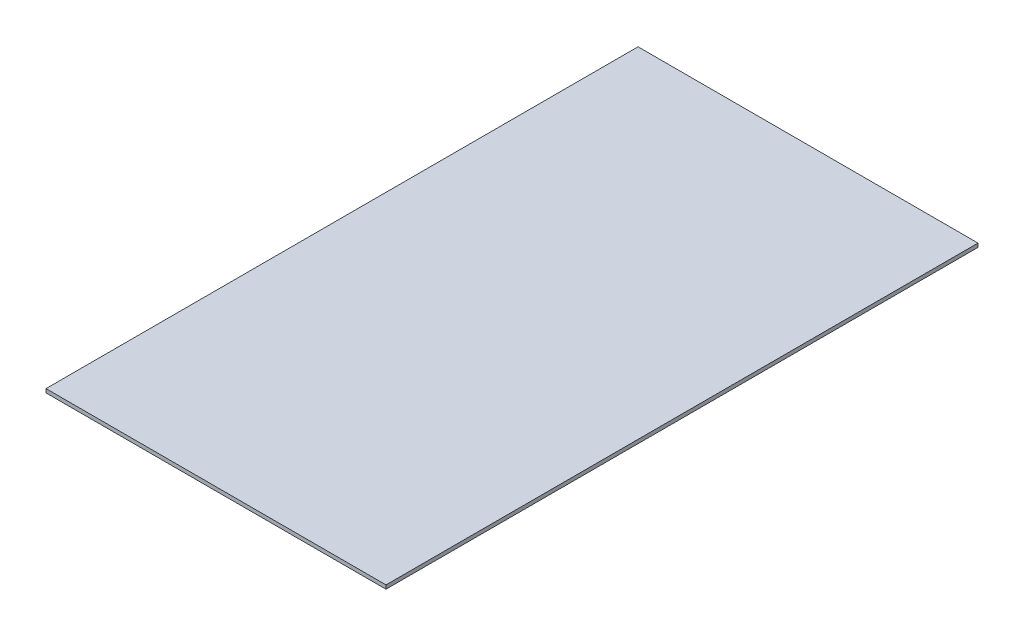
ISO-10303-21;
HEADER;
FILE_DESCRIPTION(('STEP AP214'),'2;1');
FILE_NAME('part.step','',(''),(''),'','','');
FILE_SCHEMA(('AUTOMOTIVE_DESIGN { 1 0 10303 214 1 1 1 1 }'));
ENDSEC;
DATA;
#1=APPLICATION_CONTEXT('core data for automotive mechanical design processes');
#2=APPLICATION_PROTOCOL_DEFINITION('international standard','automotive_design',2000,#1);
#3=PRODUCT_CONTEXT('',#1,'mechanical');
#4=PRODUCT('Part','Part','',(#3));
#5=PRODUCT_RELATED_PRODUCT_CATEGORY('part','',(#4));
#6=PRODUCT_DEFINITION_FORMATION('','',#4);
#7=PRODUCT_DEFINITION_CONTEXT('part definition',#1,'design');
#8=PRODUCT_DEFINITION('design','',#6,#7);
#9=PRODUCT_DEFINITION_SHAPE('','',#8);
#10=(LENGTH_UNIT() NAMED_UNIT(*) SI_UNIT(.MILLI.,.METRE.));
#11=(NAMED_UNIT(*) PLANE_ANGLE_UNIT() SI_UNIT($,.RADIAN.));
#12=(NAMED_UNIT(*) SI_UNIT($,.STERADIAN.) SOLID_ANGLE_UNIT());
#13=UNCERTAINTY_MEASURE_WITH_UNIT(LENGTH_MEASURE(1.E-05),#10,'distance_accuracy_value','');
#14=(GEOMETRIC_REPRESENTATION_CONTEXT(3) GLOBAL_UNCERTAINTY_ASSIGNED_CONTEXT((#13)) GLOBAL_UNIT_ASSIGNED_CONTEXT((#10,
#11,#12)) REPRESENTATION_CONTEXT('',''));
#15=CARTESIAN_POINT('',(0.,0.,0.));
#16=DIRECTION('',(0.,0.,1.));
#17=DIRECTION('',(1.,0.,0.));
#18=AXIS2_PLACEMENT_3D('',#15,#16,#17);
#19=CARTESIAN_POINT('',(145.,3.2,252.5));
#20=DIRECTION('',(-1.,0.,0.));
#21=DIRECTION('',(0.,0.,1.));
#22=AXIS2_PLACEMENT_3D('',#19,#20,#21);
#23=PLANE('',#22);
#24=DIRECTION('',(0.,0.,-1.));
#25=VECTOR('',#24,1.);
#26=CARTESIAN_POINT('',(145.,0.,252.5));
#27=LINE('',#26,#25);
#28=CARTESIAN_POINT('',(145.,0.,252.5));
#29=VERTEX_POINT('',#28);
#30=CARTESIAN_POINT('',(145.,0.,-252.5));
#31=VERTEX_POINT('',#30);
#32=EDGE_CURVE('E98',#29,#31,#27,.T.);
#33=ORIENTED_EDGE('',*,*,#32,.T.);
#34=DIRECTION('',(0.,-1.,0.));
#35=VECTOR('',#34,1.);
#36=CARTESIAN_POINT('',(145.,3.2,-252.5));
#37=LINE('',#36,#35);
#38=CARTESIAN_POINT('',(145.,3.2,-252.5));
#39=VERTEX_POINT('',#38);
#40=EDGE_CURVE('E11',#39,#31,#37,.T.);
#41=ORIENTED_EDGE('',*,*,#40,.F.);
#42=DIRECTION('',(0.,0.,-1.));
#43=VECTOR('',#42,1.);
#44=CARTESIAN_POINT('',(145.,3.2,252.5));
#45=LINE('',#44,#43);
#46=CARTESIAN_POINT('',(145.,3.2,252.5));
#47=VERTEX_POINT('',#46);
#48=EDGE_CURVE('E86',#47,#39,#45,.T.);
#49=ORIENTED_EDGE('',*,*,#48,.F.);
#50=DIRECTION('',(0.,-1.,0.));
#51=VECTOR('',#50,1.);
#52=CARTESIAN_POINT('',(145.,3.2,252.5));
#53=LINE('',#52,#51);
#54=EDGE_CURVE('E94',#47,#29,#53,.T.);
#55=ORIENTED_EDGE('',*,*,#54,.T.);
#56=EDGE_LOOP('',(#33,#41,#49,#55));
#57=FACE_BOUND('',#56,.T.);
#58=ADVANCED_FACE('F35',(#57),#23,.F.);
#59=CARTESIAN_POINT('',(-145.,3.2,-252.5));
#60=DIRECTION('',(0.,0.,1.));
#61=DIRECTION('',(1.,0.,0.));
#62=AXIS2_PLACEMENT_3D('',#59,#60,#61);
#63=PLANE('',#62);
#64=DIRECTION('',(-1.,0.,0.));
#65=VECTOR('',#64,1.);
#66=CARTESIAN_POINT('',(-145.,0.,-252.5));
#67=LINE('',#66,#65);
#68=CARTESIAN_POINT('',(-145.,0.,-252.5));
#69=VERTEX_POINT('',#68);
#70=EDGE_CURVE('E90',#31,#69,#67,.T.);
#71=ORIENTED_EDGE('',*,*,#70,.T.);
#72=DIRECTION('',(0.,-1.,0.));
#73=VECTOR('',#72,1.);
#74=CARTESIAN_POINT('',(-145.,3.2,-252.5));
#75=LINE('',#74,#73);
#76=CARTESIAN_POINT('',(-145.,3.2,-252.5));
#77=VERTEX_POINT('',#76);
#78=EDGE_CURVE('E43',#77,#69,#75,.T.);
#79=ORIENTED_EDGE('',*,*,#78,.F.);
#80=DIRECTION('',(-1.,0.,0.));
#81=VECTOR('',#80,1.);
#82=CARTESIAN_POINT('',(-145.,3.2,-252.5));
#83=LINE('',#82,#81);
#84=EDGE_CURVE('E81',#39,#77,#83,.T.);
#85=ORIENTED_EDGE('',*,*,#84,.F.);
#86=ORIENTED_EDGE('',*,*,#40,.T.);
#87=EDGE_LOOP('',(#71,#79,#85,#86));
#88=FACE_BOUND('',#87,.T.);
#89=ADVANCED_FACE('F89',(#88),#63,.F.);
#90=CARTESIAN_POINT('',(-145.,3.2,252.5));
#91=DIRECTION('',(1.,0.,0.));
#92=DIRECTION('',(0.,0.,-1.));
#93=AXIS2_PLACEMENT_3D('',#90,#91,#92);
#94=PLANE('',#93);
#95=DIRECTION('',(0.,0.,1.));
#96=VECTOR('',#95,1.);
#97=CARTESIAN_POINT('',(-145.,0.,252.5));
#98=LINE('',#97,#96);
#99=CARTESIAN_POINT('',(-145.,0.,252.5));
#100=VERTEX_POINT('',#99);
#101=EDGE_CURVE('E68',#69,#100,#98,.T.);
#102=ORIENTED_EDGE('',*,*,#101,.T.);
#103=DIRECTION('',(0.,-1.,0.));
#104=VECTOR('',#103,1.);
#105=CARTESIAN_POINT('',(-145.,3.2,252.5));
#106=LINE('',#105,#104);
#107=CARTESIAN_POINT('',(-145.,3.2,252.5));
#108=VERTEX_POINT('',#107);
#109=EDGE_CURVE('E91',#108,#100,#106,.T.);
#110=ORIENTED_EDGE('',*,*,#109,.F.);
#111=DIRECTION('',(0.,0.,1.));
#112=VECTOR('',#111,1.);
#113=CARTESIAN_POINT('',(-145.,3.2,252.5));
#114=LINE('',#113,#112);
#115=EDGE_CURVE('E84',#77,#108,#114,.T.);
#116=ORIENTED_EDGE('',*,*,#115,.F.);
#117=ORIENTED_EDGE('',*,*,#78,.T.);
#118=EDGE_LOOP('',(#102,#110,#116,#117));
#119=FACE_BOUND('',#118,.T.);
#120=ADVANCED_FACE('F92',(#119),#94,.F.);
#121=CARTESIAN_POINT('',(-145.,3.2,252.5));
#122=DIRECTION('',(0.,0.,-1.));
#123=DIRECTION('',(-1.,0.,0.));
#124=AXIS2_PLACEMENT_3D('',#121,#122,#123);
#125=PLANE('',#124);
#126=DIRECTION('',(1.,0.,0.));
#127=VECTOR('',#126,1.);
#128=CARTESIAN_POINT('',(-145.,0.,252.5));
#129=LINE('',#128,#127);
#130=EDGE_CURVE('E74',#100,#29,#129,.T.);
#131=ORIENTED_EDGE('',*,*,#130,.T.);
#132=ORIENTED_EDGE('',*,*,#54,.F.);
#133=DIRECTION('',(1.,0.,0.));
#134=VECTOR('',#133,1.);
#135=CARTESIAN_POINT('',(-145.,3.2,252.5));
#136=LINE('',#135,#134);
#137=EDGE_CURVE('E51',#108,#47,#136,.T.);
#138=ORIENTED_EDGE('',*,*,#137,.F.);
#139=ORIENTED_EDGE('',*,*,#109,.T.);
#140=EDGE_LOOP('',(#131,#132,#138,#139));
#141=FACE_BOUND('',#140,.T.);
#142=ADVANCED_FACE('F105',(#141),#125,.F.);
#143=CARTESIAN_POINT('',(0.,3.2,0.));
#144=DIRECTION('',(0.,-1.,0.));
#145=DIRECTION('',(0.,0.,-1.));
#146=AXIS2_PLACEMENT_3D('',#143,#144,#145);
#147=PLANE('',#146);
#148=ORIENTED_EDGE('',*,*,#48,.T.);
#149=ORIENTED_EDGE('',*,*,#84,.T.);
#150=ORIENTED_EDGE('',*,*,#115,.T.);
#151=ORIENTED_EDGE('',*,*,#137,.T.);
#152=EDGE_LOOP('',(#148,#149,#150,#151));
#153=FACE_BOUND('',#152,.T.);
#154=ADVANCED_FACE('F82',(#153),#147,.F.);
#155=CARTESIAN_POINT('',(0.,0.,0.));
#156=DIRECTION('',(0.,-1.,0.));
#157=DIRECTION('',(0.,0.,-1.));
#158=AXIS2_PLACEMENT_3D('',#155,#156,#157);
#159=PLANE('',#158);
#160=ORIENTED_EDGE('',*,*,#32,.F.);
#161=ORIENTED_EDGE('',*,*,#130,.F.);
#162=ORIENTED_EDGE('',*,*,#101,.F.);
#163=ORIENTED_EDGE('',*,*,#70,.F.);
#164=EDGE_LOOP('',(#160,#161,#162,#163));
#165=FACE_BOUND('',#164,.T.);
#166=ADVANCED_FACE('F108',(#165),#159,.T.);
#167=CLOSED_SHELL('',(#58,#89,#120,#142,#154,#166));
#168=MANIFOLD_SOLID_BREP('B2',#167);
#169=ADVANCED_BREP_SHAPE_REPRESENTATION('',(#18,#168),#14);
#170=SHAPE_DEFINITION_REPRESENTATION(#9,#169);
ENDSEC;
END-ISO-10303-21;
